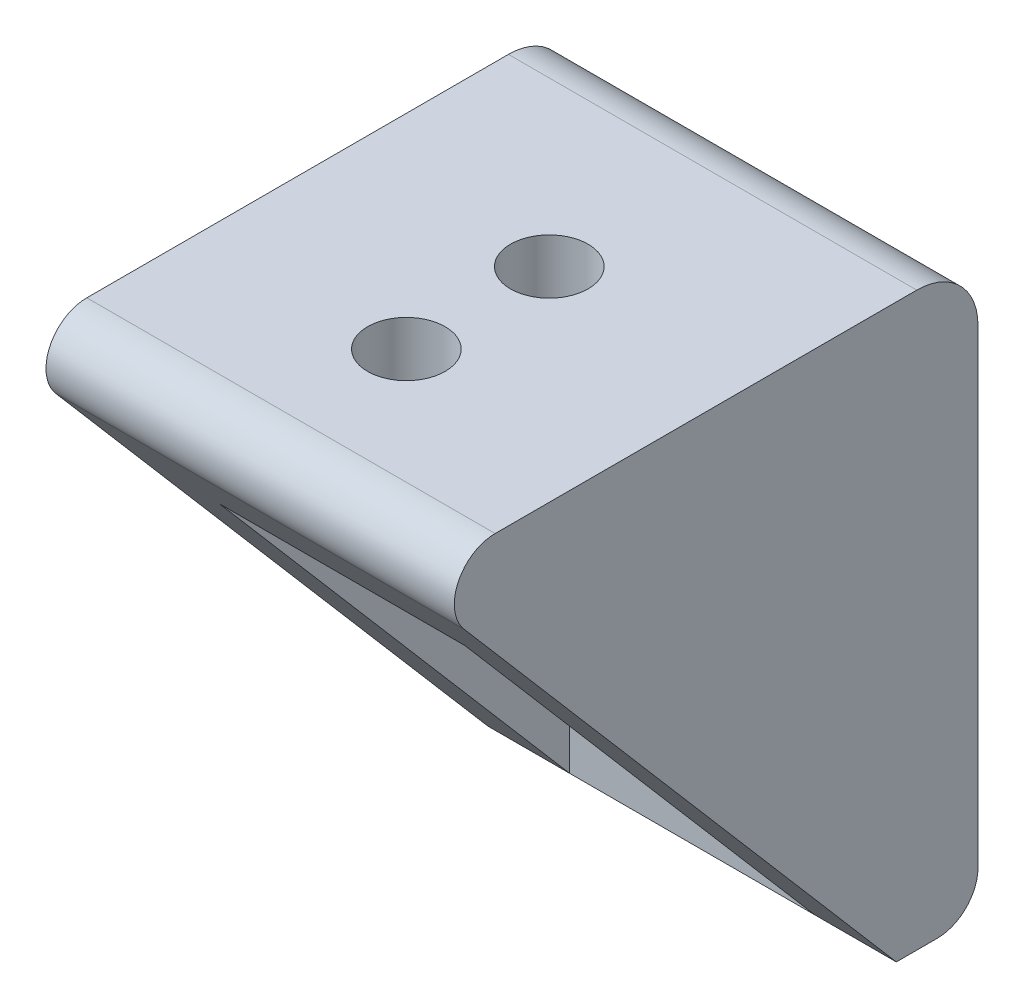
ISO-10303-21;
HEADER;
FILE_DESCRIPTION(('STEP AP214'),'2;1');
FILE_NAME('part.step','',(''),(''),'','','');
FILE_SCHEMA(('AUTOMOTIVE_DESIGN { 1 0 10303 214 1 1 1 1 }'));
ENDSEC;
DATA;
#1=APPLICATION_CONTEXT('core data for automotive mechanical design processes');
#2=APPLICATION_PROTOCOL_DEFINITION('international standard','automotive_design',2000,#1);
#3=PRODUCT_CONTEXT('',#1,'mechanical');
#4=PRODUCT('Part','Part','',(#3));
#5=PRODUCT_RELATED_PRODUCT_CATEGORY('part','',(#4));
#6=PRODUCT_DEFINITION_FORMATION('','',#4);
#7=PRODUCT_DEFINITION_CONTEXT('part definition',#1,'design');
#8=PRODUCT_DEFINITION('design','',#6,#7);
#9=PRODUCT_DEFINITION_SHAPE('','',#8);
#10=(LENGTH_UNIT() NAMED_UNIT(*) SI_UNIT(.MILLI.,.METRE.));
#11=(NAMED_UNIT(*) PLANE_ANGLE_UNIT() SI_UNIT($,.RADIAN.));
#12=(NAMED_UNIT(*) SI_UNIT($,.STERADIAN.) SOLID_ANGLE_UNIT());
#13=UNCERTAINTY_MEASURE_WITH_UNIT(LENGTH_MEASURE(1.E-05),#10,'distance_accuracy_value','');
#14=(GEOMETRIC_REPRESENTATION_CONTEXT(3) GLOBAL_UNCERTAINTY_ASSIGNED_CONTEXT((#13)) GLOBAL_UNIT_ASSIGNED_CONTEXT((#10,
#11,#12)) REPRESENTATION_CONTEXT('',''));
#15=CARTESIAN_POINT('',(0.,0.,0.));
#16=DIRECTION('',(0.,0.,1.));
#17=DIRECTION('',(1.,0.,0.));
#18=AXIS2_PLACEMENT_3D('',#15,#16,#17);
#19=CARTESIAN_POINT('',(-10.,-14.,28.));
#20=DIRECTION('',(0.,1.,0.));
#21=DIRECTION('',(0.,0.,1.));
#22=AXIS2_PLACEMENT_3D('',#19,#20,#21);
#23=PLANE('',#22);
#24=DIRECTION('',(0.,0.,-1.));
#25=VECTOR('',#24,1.);
#26=CARTESIAN_POINT('',(-10.,-14.,28.));
#27=LINE('',#26,#25);
#28=CARTESIAN_POINT('',(-10.,-14.,4.));
#29=VERTEX_POINT('',#28);
#30=CARTESIAN_POINT('',(-10.,-14.,2.));
#31=VERTEX_POINT('',#30);
#32=EDGE_CURVE('E126',#29,#31,#27,.T.);
#33=ORIENTED_EDGE('',*,*,#32,.T.);
#34=DIRECTION('',(1.,0.,0.));
#35=VECTOR('',#34,1.);
#36=CARTESIAN_POINT('',(10.,-14.,2.));
#37=LINE('',#36,#35);
#38=CARTESIAN_POINT('',(10.,-14.,2.));
#39=VERTEX_POINT('',#38);
#40=EDGE_CURVE('E157',#31,#39,#37,.T.);
#41=ORIENTED_EDGE('',*,*,#40,.T.);
#42=DIRECTION('',(0.,0.,-1.));
#43=VECTOR('',#42,1.);
#44=CARTESIAN_POINT('',(10.,-14.,28.));
#45=LINE('',#44,#43);
#46=CARTESIAN_POINT('',(10.,-14.,4.));
#47=VERTEX_POINT('',#46);
#48=EDGE_CURVE('E137',#47,#39,#45,.T.);
#49=ORIENTED_EDGE('',*,*,#48,.F.);
#50=DIRECTION('',(-1.,0.,0.));
#51=VECTOR('',#50,1.);
#52=CARTESIAN_POINT('',(46.8781778291715,-14.,4.));
#53=LINE('',#52,#51);
#54=CARTESIAN_POINT('',(6.,-14.,4.));
#55=VERTEX_POINT('',#54);
#56=EDGE_CURVE('E131',#47,#55,#53,.T.);
#57=ORIENTED_EDGE('',*,*,#56,.T.);
#58=DIRECTION('',(-1.,0.,0.));
#59=VECTOR('',#58,1.);
#60=CARTESIAN_POINT('',(41.2409987036266,-14.,4.));
#61=LINE('',#60,#59);
#62=CARTESIAN_POINT('',(-6.00000000000001,-14.,4.));
#63=VERTEX_POINT('',#62);
#64=EDGE_CURVE('E130',#55,#63,#61,.T.);
#65=ORIENTED_EDGE('',*,*,#64,.T.);
#66=EDGE_CURVE('E115',#63,#29,#53,.T.);
#67=ORIENTED_EDGE('',*,*,#66,.T.);
#68=EDGE_LOOP('',(#33,#41,#49,#57,#65,#67));
#69=FACE_BOUND('',#68,.T.);
#70=ADVANCED_FACE('F35',(#69),#23,.F.);
#71=CARTESIAN_POINT('',(10.,-14.,28.));
#72=DIRECTION('',(-1.,0.,0.));
#73=DIRECTION('',(0.,0.,1.));
#74=AXIS2_PLACEMENT_3D('',#71,#72,#73);
#75=PLANE('',#74);
#76=DIRECTION('',(0.,1.,0.));
#77=VECTOR('',#76,1.);
#78=CARTESIAN_POINT('',(10.,-14.,0.));
#79=LINE('',#78,#77);
#80=CARTESIAN_POINT('',(10.,-12.,0.));
#81=VERTEX_POINT('',#80);
#82=CARTESIAN_POINT('',(10.,11.,0.));
#83=VERTEX_POINT('',#82);
#84=EDGE_CURVE('E188',#81,#83,#79,.T.);
#85=ORIENTED_EDGE('',*,*,#84,.T.);
#86=CARTESIAN_POINT('',(10.,11.,3.));
#87=DIRECTION('',(-1.,0.,0.));
#88=DIRECTION('',(0.,0.,1.));
#89=AXIS2_PLACEMENT_3D('',#86,#87,#88);
#90=CIRCLE('',#89,3.);
#91=CARTESIAN_POINT('',(10.,14.,3.));
#92=VERTEX_POINT('',#91);
#93=EDGE_CURVE('E12',#83,#92,#90,.F.);
#94=ORIENTED_EDGE('',*,*,#93,.T.);
#95=DIRECTION('',(0.,0.,-1.));
#96=VECTOR('',#95,1.);
#97=CARTESIAN_POINT('',(10.,14.,28.));
#98=LINE('',#97,#96);
#99=CARTESIAN_POINT('',(10.,14.,23.6515587264877));
#100=VERTEX_POINT('',#99);
#101=EDGE_CURVE('E139',#100,#92,#98,.T.);
#102=ORIENTED_EDGE('',*,*,#101,.F.);
#103=CARTESIAN_POINT('',(10.,12.,23.6515587264877));
#104=DIRECTION('',(-1.,0.,0.));
#105=DIRECTION('',(0.,0.,1.));
#106=AXIS2_PLACEMENT_3D('',#103,#104,#105);
#107=CIRCLE('',#106,2.);
#108=CARTESIAN_POINT('',(10.,10.6984172530881,25.1700719312183));
#109=VERTEX_POINT('',#108);
#110=EDGE_CURVE('E155',#100,#109,#107,.F.);
#111=ORIENTED_EDGE('',*,*,#110,.T.);
#112=DIRECTION('',(0.,0.759256602365297,0.650791373455968));
#113=VECTOR('',#112,1.);
#114=CARTESIAN_POINT('',(10.,14.,28.));
#115=LINE('',#114,#113);
#116=EDGE_CURVE('E275',#47,#109,#115,.T.);
#117=ORIENTED_EDGE('',*,*,#116,.F.);
#118=ORIENTED_EDGE('',*,*,#48,.T.);
#119=CARTESIAN_POINT('',(10.,-12.,2.));
#120=DIRECTION('',(-1.,0.,0.));
#121=DIRECTION('',(0.,0.,1.));
#122=AXIS2_PLACEMENT_3D('',#119,#120,#121);
#123=CIRCLE('',#122,2.);
#124=EDGE_CURVE('E165',#39,#81,#123,.F.);
#125=ORIENTED_EDGE('',*,*,#124,.T.);
#126=EDGE_LOOP('',(#85,#94,#102,#111,#117,#118,#125));
#127=FACE_BOUND('',#126,.T.);
#128=ADVANCED_FACE('F186',(#127),#75,.F.);
#129=CARTESIAN_POINT('',(-10.,14.,28.));
#130=DIRECTION('',(0.,-1.,0.));
#131=DIRECTION('',(0.,0.,-1.));
#132=AXIS2_PLACEMENT_3D('',#129,#130,#131);
#133=PLANE('',#132);
#134=CARTESIAN_POINT('',(0.,14.,11.));
#135=DIRECTION('',(0.,1.,0.));
#136=DIRECTION('',(0.,0.,1.));
#137=AXIS2_PLACEMENT_3D('',#134,#135,#136);
#138=CIRCLE('',#137,1.9);
#139=CARTESIAN_POINT('',(0.,14.,12.9));
#140=VERTEX_POINT('',#139);
#141=EDGE_CURVE('E161',#140,#140,#138,.T.);
#142=ORIENTED_EDGE('',*,*,#141,.F.);
#143=EDGE_LOOP('',(#142));
#144=FACE_BOUND('',#143,.T.);
#145=CARTESIAN_POINT('',(0.,14.,18.));
#146=DIRECTION('',(0.,1.,0.));
#147=DIRECTION('',(0.,0.,1.));
#148=AXIS2_PLACEMENT_3D('',#145,#146,#147);
#149=CIRCLE('',#148,1.9);
#150=CARTESIAN_POINT('',(0.,14.,19.9));
#151=VERTEX_POINT('',#150);
#152=EDGE_CURVE('E283',#151,#151,#149,.T.);
#153=ORIENTED_EDGE('',*,*,#152,.F.);
#154=EDGE_LOOP('',(#153));
#155=FACE_BOUND('',#154,.T.);
#156=ORIENTED_EDGE('',*,*,#101,.T.);
#157=DIRECTION('',(-1.,0.,0.));
#158=VECTOR('',#157,1.);
#159=CARTESIAN_POINT('',(-10.,14.,3.));
#160=LINE('',#159,#158);
#161=CARTESIAN_POINT('',(-10.,14.,3.));
#162=VERTEX_POINT('',#161);
#163=EDGE_CURVE('E171',#92,#162,#160,.T.);
#164=ORIENTED_EDGE('',*,*,#163,.T.);
#165=DIRECTION('',(0.,0.,-1.));
#166=VECTOR('',#165,1.);
#167=CARTESIAN_POINT('',(-10.,14.,28.));
#168=LINE('',#167,#166);
#169=CARTESIAN_POINT('',(-10.,14.,23.6515587264877));
#170=VERTEX_POINT('',#169);
#171=EDGE_CURVE('E136',#170,#162,#168,.T.);
#172=ORIENTED_EDGE('',*,*,#171,.F.);
#173=DIRECTION('',(-1.,0.,0.));
#174=VECTOR('',#173,1.);
#175=CARTESIAN_POINT('',(-10.,14.,23.6515587264877));
#176=LINE('',#175,#174);
#177=EDGE_CURVE('E153',#170,#100,#176,.F.);
#178=ORIENTED_EDGE('',*,*,#177,.T.);
#179=EDGE_LOOP('',(#156,#164,#172,#178));
#180=FACE_BOUND('',#179,.T.);
#181=ADVANCED_FACE('F177',(#144,#155,#180),#133,.F.);
#182=CARTESIAN_POINT('',(-10.,-14.,28.));
#183=DIRECTION('',(1.,0.,0.));
#184=DIRECTION('',(0.,0.,-1.));
#185=AXIS2_PLACEMENT_3D('',#182,#183,#184);
#186=PLANE('',#185);
#187=ORIENTED_EDGE('',*,*,#171,.T.);
#188=CARTESIAN_POINT('',(-10.,11.,3.));
#189=DIRECTION('',(1.,0.,0.));
#190=DIRECTION('',(0.,0.,-1.));
#191=AXIS2_PLACEMENT_3D('',#188,#189,#190);
#192=CIRCLE('',#191,3.);
#193=CARTESIAN_POINT('',(-10.,11.,0.));
#194=VERTEX_POINT('',#193);
#195=EDGE_CURVE('E57',#162,#194,#192,.F.);
#196=ORIENTED_EDGE('',*,*,#195,.T.);
#197=DIRECTION('',(0.,-1.,0.));
#198=VECTOR('',#197,1.);
#199=CARTESIAN_POINT('',(-10.,-14.,0.));
#200=LINE('',#199,#198);
#201=CARTESIAN_POINT('',(-10.,-12.,0.));
#202=VERTEX_POINT('',#201);
#203=EDGE_CURVE('E142',#194,#202,#200,.T.);
#204=ORIENTED_EDGE('',*,*,#203,.T.);
#205=CARTESIAN_POINT('',(-10.,-12.,2.));
#206=DIRECTION('',(1.,0.,0.));
#207=DIRECTION('',(0.,0.,-1.));
#208=AXIS2_PLACEMENT_3D('',#205,#206,#207);
#209=CIRCLE('',#208,2.);
#210=EDGE_CURVE('E135',#202,#31,#209,.F.);
#211=ORIENTED_EDGE('',*,*,#210,.T.);
#212=ORIENTED_EDGE('',*,*,#32,.F.);
#213=DIRECTION('',(0.,-0.759256602365297,-0.650791373455968));
#214=VECTOR('',#213,1.);
#215=CARTESIAN_POINT('',(-10.,14.,28.));
#216=LINE('',#215,#214);
#217=CARTESIAN_POINT('',(-10.,10.6984172530881,25.1700719312183));
#218=VERTEX_POINT('',#217);
#219=EDGE_CURVE('E111',#218,#29,#216,.T.);
#220=ORIENTED_EDGE('',*,*,#219,.F.);
#221=CARTESIAN_POINT('',(-10.,12.,23.6515587264877));
#222=DIRECTION('',(1.,0.,0.));
#223=DIRECTION('',(0.,0.,-1.));
#224=AXIS2_PLACEMENT_3D('',#221,#222,#223);
#225=CIRCLE('',#224,2.);
#226=EDGE_CURVE('E151',#218,#170,#225,.F.);
#227=ORIENTED_EDGE('',*,*,#226,.T.);
#228=EDGE_LOOP('',(#187,#196,#204,#211,#212,#220,#227));
#229=FACE_BOUND('',#228,.T.);
#230=ADVANCED_FACE('F133',(#229),#186,.F.);
#231=CARTESIAN_POINT('',(0.,0.,0.));
#232=DIRECTION('',(0.,0.,-1.));
#233=DIRECTION('',(-1.,0.,0.));
#234=AXIS2_PLACEMENT_3D('',#231,#232,#233);
#235=PLANE('',#234);
#236=CARTESIAN_POINT('',(0.,-2.,0.));
#237=DIRECTION('',(0.,0.,1.));
#238=DIRECTION('',(1.,0.,0.));
#239=AXIS2_PLACEMENT_3D('',#236,#237,#238);
#240=CIRCLE('',#239,1.9);
#241=CARTESIAN_POINT('',(1.9,-2.,0.));
#242=VERTEX_POINT('',#241);
#243=EDGE_CURVE('E286',#242,#242,#240,.T.);
#244=ORIENTED_EDGE('',*,*,#243,.T.);
#245=EDGE_LOOP('',(#244));
#246=FACE_BOUND('',#245,.T.);
#247=CARTESIAN_POINT('',(0.,-10.,0.));
#248=DIRECTION('',(0.,0.,1.));
#249=DIRECTION('',(1.,0.,0.));
#250=AXIS2_PLACEMENT_3D('',#247,#248,#249);
#251=CIRCLE('',#250,1.9);
#252=CARTESIAN_POINT('',(1.9,-10.,0.));
#253=VERTEX_POINT('',#252);
#254=EDGE_CURVE('E290',#253,#253,#251,.T.);
#255=ORIENTED_EDGE('',*,*,#254,.T.);
#256=EDGE_LOOP('',(#255));
#257=FACE_BOUND('',#256,.T.);
#258=ORIENTED_EDGE('',*,*,#203,.F.);
#259=DIRECTION('',(-1.,0.,0.));
#260=VECTOR('',#259,1.);
#261=CARTESIAN_POINT('',(10.,11.,0.));
#262=LINE('',#261,#260);
#263=EDGE_CURVE('E43',#194,#83,#262,.F.);
#264=ORIENTED_EDGE('',*,*,#263,.T.);
#265=ORIENTED_EDGE('',*,*,#84,.F.);
#266=DIRECTION('',(1.,0.,0.));
#267=VECTOR('',#266,1.);
#268=CARTESIAN_POINT('',(-10.,-12.,0.));
#269=LINE('',#268,#267);
#270=EDGE_CURVE('E167',#81,#202,#269,.F.);
#271=ORIENTED_EDGE('',*,*,#270,.T.);
#272=EDGE_LOOP('',(#258,#264,#265,#271));
#273=FACE_BOUND('',#272,.T.);
#274=ADVANCED_FACE('F204',(#246,#257,#273),#235,.T.);
#275=CARTESIAN_POINT('',(41.2409987036266,6.,4.));
#276=DIRECTION('',(0.,0.,-1.));
#277=DIRECTION('',(0.,1.,0.));
#278=AXIS2_PLACEMENT_3D('',#275,#276,#277);
#279=PLANE('',#278);
#280=CARTESIAN_POINT('',(0.,-2.,4.));
#281=DIRECTION('',(0.,0.,1.));
#282=DIRECTION('',(1.,0.,0.));
#283=AXIS2_PLACEMENT_3D('',#280,#281,#282);
#284=CIRCLE('',#283,1.9);
#285=CARTESIAN_POINT('',(1.9,-2.,4.));
#286=VERTEX_POINT('',#285);
#287=EDGE_CURVE('E246',#286,#286,#284,.T.);
#288=ORIENTED_EDGE('',*,*,#287,.F.);
#289=EDGE_LOOP('',(#288));
#290=FACE_BOUND('',#289,.T.);
#291=CARTESIAN_POINT('',(0.,-10.,4.));
#292=DIRECTION('',(0.,0.,1.));
#293=DIRECTION('',(1.,0.,0.));
#294=AXIS2_PLACEMENT_3D('',#291,#292,#293);
#295=CIRCLE('',#294,1.9);
#296=CARTESIAN_POINT('',(1.9,-10.,4.));
#297=VERTEX_POINT('',#296);
#298=EDGE_CURVE('E250',#297,#297,#295,.T.);
#299=ORIENTED_EDGE('',*,*,#298,.F.);
#300=EDGE_LOOP('',(#299));
#301=FACE_BOUND('',#300,.T.);
#302=DIRECTION('',(0.,1.,0.));
#303=VECTOR('',#302,1.);
#304=CARTESIAN_POINT('',(6.,6.,4.));
#305=LINE('',#304,#303);
#306=CARTESIAN_POINT('',(6.,6.,4.));
#307=VERTEX_POINT('',#306);
#308=EDGE_CURVE('E252',#55,#307,#305,.T.);
#309=ORIENTED_EDGE('',*,*,#308,.T.);
#310=DIRECTION('',(-1.,0.,0.));
#311=VECTOR('',#310,1.);
#312=CARTESIAN_POINT('',(41.2409987036266,6.,4.));
#313=LINE('',#312,#311);
#314=CARTESIAN_POINT('',(-6.00000000000001,6.,4.));
#315=VERTEX_POINT('',#314);
#316=EDGE_CURVE('E256',#307,#315,#313,.T.);
#317=ORIENTED_EDGE('',*,*,#316,.T.);
#318=DIRECTION('',(0.,1.,0.));
#319=VECTOR('',#318,1.);
#320=CARTESIAN_POINT('',(-6.00000000000001,6.,4.));
#321=LINE('',#320,#319);
#322=EDGE_CURVE('E270',#63,#315,#321,.T.);
#323=ORIENTED_EDGE('',*,*,#322,.F.);
#324=ORIENTED_EDGE('',*,*,#64,.F.);
#325=EDGE_LOOP('',(#309,#317,#323,#324));
#326=FACE_BOUND('',#325,.T.);
#327=ADVANCED_FACE('F235',(#290,#301,#326),#279,.F.);
#328=CARTESIAN_POINT('',(41.2409987036266,6.,4.));
#329=DIRECTION('',(0.,1.,0.));
#330=DIRECTION('',(0.,0.,1.));
#331=AXIS2_PLACEMENT_3D('',#328,#329,#330);
#332=PLANE('',#331);
#333=CARTESIAN_POINT('',(0.,6.,11.));
#334=DIRECTION('',(0.,1.,0.));
#335=DIRECTION('',(0.,0.,1.));
#336=AXIS2_PLACEMENT_3D('',#333,#334,#335);
#337=CIRCLE('',#336,1.9);
#338=CARTESIAN_POINT('',(0.,6.,12.9));
#339=VERTEX_POINT('',#338);
#340=EDGE_CURVE('E120',#339,#339,#337,.T.);
#341=ORIENTED_EDGE('',*,*,#340,.T.);
#342=EDGE_LOOP('',(#341));
#343=FACE_BOUND('',#342,.T.);
#344=CARTESIAN_POINT('',(0.,6.,18.));
#345=DIRECTION('',(0.,1.,0.));
#346=DIRECTION('',(0.,0.,1.));
#347=AXIS2_PLACEMENT_3D('',#344,#345,#346);
#348=CIRCLE('',#347,1.9);
#349=CARTESIAN_POINT('',(0.,6.,19.9));
#350=VERTEX_POINT('',#349);
#351=EDGE_CURVE('E158',#350,#350,#348,.T.);
#352=ORIENTED_EDGE('',*,*,#351,.T.);
#353=EDGE_LOOP('',(#352));
#354=FACE_BOUND('',#353,.T.);
#355=DIRECTION('',(0.,0.,1.));
#356=VECTOR('',#355,1.);
#357=CARTESIAN_POINT('',(6.,6.,4.));
#358=LINE('',#357,#356);
#359=CARTESIAN_POINT('',(6.,6.,21.1428571428571));
#360=VERTEX_POINT('',#359);
#361=EDGE_CURVE('E259',#307,#360,#358,.T.);
#362=ORIENTED_EDGE('',*,*,#361,.T.);
#363=DIRECTION('',(-1.,0.,0.));
#364=VECTOR('',#363,1.);
#365=CARTESIAN_POINT('',(41.2409987036266,6.,21.1428571428571));
#366=LINE('',#365,#364);
#367=CARTESIAN_POINT('',(-6.,6.,21.1428571428571));
#368=VERTEX_POINT('',#367);
#369=EDGE_CURVE('E276',#360,#368,#366,.T.);
#370=ORIENTED_EDGE('',*,*,#369,.T.);
#371=DIRECTION('',(0.,0.,1.));
#372=VECTOR('',#371,1.);
#373=CARTESIAN_POINT('',(-6.00000000000001,6.,4.));
#374=LINE('',#373,#372);
#375=EDGE_CURVE('E267',#315,#368,#374,.T.);
#376=ORIENTED_EDGE('',*,*,#375,.F.);
#377=ORIENTED_EDGE('',*,*,#316,.F.);
#378=EDGE_LOOP('',(#362,#370,#376,#377));
#379=FACE_BOUND('',#378,.T.);
#380=ADVANCED_FACE('F232',(#343,#354,#379),#332,.F.);
#381=CARTESIAN_POINT('',(6.,-14.,28.));
#382=DIRECTION('',(-1.,0.,0.));
#383=DIRECTION('',(0.,0.,1.));
#384=AXIS2_PLACEMENT_3D('',#381,#382,#383);
#385=PLANE('',#384);
#386=DIRECTION('',(0.,-0.759256602365297,-0.650791373455968));
#387=VECTOR('',#386,1.);
#388=CARTESIAN_POINT('',(6.,-2.14117647058824,14.1647058823529));
#389=LINE('',#388,#387);
#390=EDGE_CURVE('E262',#360,#55,#389,.T.);
#391=ORIENTED_EDGE('',*,*,#390,.F.);
#392=ORIENTED_EDGE('',*,*,#361,.F.);
#393=ORIENTED_EDGE('',*,*,#308,.F.);
#394=EDGE_LOOP('',(#391,#392,#393));
#395=FACE_BOUND('',#394,.T.);
#396=ADVANCED_FACE('F225',(#395),#385,.T.);
#397=CARTESIAN_POINT('',(-6.,-14.,28.));
#398=DIRECTION('',(1.,0.,0.));
#399=DIRECTION('',(0.,0.,-1.));
#400=AXIS2_PLACEMENT_3D('',#397,#398,#399);
#401=PLANE('',#400);
#402=DIRECTION('',(0.,0.759256602365297,0.650791373455968));
#403=VECTOR('',#402,1.);
#404=CARTESIAN_POINT('',(-6.,-2.14117647058824,14.1647058823529));
#405=LINE('',#404,#403);
#406=EDGE_CURVE('E148',#63,#368,#405,.T.);
#407=ORIENTED_EDGE('',*,*,#406,.F.);
#408=ORIENTED_EDGE('',*,*,#322,.T.);
#409=ORIENTED_EDGE('',*,*,#375,.T.);
#410=EDGE_LOOP('',(#407,#408,#409));
#411=FACE_BOUND('',#410,.T.);
#412=ADVANCED_FACE('F220',(#411),#401,.T.);
#413=CARTESIAN_POINT('',(46.8781778291715,14.,28.));
#414=DIRECTION('',(0.,0.650791373455968,-0.759256602365297));
#415=DIRECTION('',(0.,0.759256602365297,0.650791373455968));
#416=AXIS2_PLACEMENT_3D('',#413,#414,#415);
#417=PLANE('',#416);
#418=ORIENTED_EDGE('',*,*,#116,.T.);
#419=DIRECTION('',(-1.,0.,0.));
#420=VECTOR('',#419,1.);
#421=CARTESIAN_POINT('',(46.8781778291715,10.6984172530881,25.1700719312183));
#422=LINE('',#421,#420);
#423=EDGE_CURVE('E118',#109,#218,#422,.T.);
#424=ORIENTED_EDGE('',*,*,#423,.T.);
#425=ORIENTED_EDGE('',*,*,#219,.T.);
#426=ORIENTED_EDGE('',*,*,#66,.F.);
#427=ORIENTED_EDGE('',*,*,#406,.T.);
#428=ORIENTED_EDGE('',*,*,#369,.F.);
#429=ORIENTED_EDGE('',*,*,#390,.T.);
#430=ORIENTED_EDGE('',*,*,#56,.F.);
#431=EDGE_LOOP('',(#418,#424,#425,#426,#427,#428,#429,#430));
#432=FACE_BOUND('',#431,.T.);
#433=ADVANCED_FACE('F114',(#432),#417,.F.);
#434=CARTESIAN_POINT('',(46.8781778291715,12.,23.6515587264877));
#435=DIRECTION('',(-1.,0.,0.));
#436=DIRECTION('',(0.,0.,1.));
#437=AXIS2_PLACEMENT_3D('',#434,#435,#436);
#438=CYLINDRICAL_SURFACE('',#437,2.);
#439=ORIENTED_EDGE('',*,*,#110,.F.);
#440=ORIENTED_EDGE('',*,*,#177,.F.);
#441=ORIENTED_EDGE('',*,*,#226,.F.);
#442=ORIENTED_EDGE('',*,*,#423,.F.);
#443=EDGE_LOOP('',(#439,#440,#441,#442));
#444=FACE_BOUND('',#443,.T.);
#445=ADVANCED_FACE('F184',(#444),#438,.T.);
#446=CARTESIAN_POINT('',(0.,4.,18.));
#447=DIRECTION('',(0.,1.,0.));
#448=DIRECTION('',(0.,0.,1.));
#449=AXIS2_PLACEMENT_3D('',#446,#447,#448);
#450=CYLINDRICAL_SURFACE('',#449,1.9);
#451=ORIENTED_EDGE('',*,*,#152,.T.);
#452=EDGE_LOOP('',(#451));
#453=FACE_BOUND('',#452,.T.);
#454=ORIENTED_EDGE('',*,*,#351,.F.);
#455=EDGE_LOOP('',(#454));
#456=FACE_BOUND('',#455,.T.);
#457=ADVANCED_FACE('F212',(#453,#456),#450,.F.);
#458=CARTESIAN_POINT('',(0.,4.,11.));
#459=DIRECTION('',(0.,1.,0.));
#460=DIRECTION('',(0.,0.,1.));
#461=AXIS2_PLACEMENT_3D('',#458,#459,#460);
#462=CYLINDRICAL_SURFACE('',#461,1.9);
#463=ORIENTED_EDGE('',*,*,#141,.T.);
#464=EDGE_LOOP('',(#463));
#465=FACE_BOUND('',#464,.T.);
#466=ORIENTED_EDGE('',*,*,#340,.F.);
#467=EDGE_LOOP('',(#466));
#468=FACE_BOUND('',#467,.T.);
#469=ADVANCED_FACE('F217',(#465,#468),#462,.F.);
#470=CARTESIAN_POINT('',(0.,-10.,0.));
#471=DIRECTION('',(0.,0.,1.));
#472=DIRECTION('',(1.,0.,0.));
#473=AXIS2_PLACEMENT_3D('',#470,#471,#472);
#474=CYLINDRICAL_SURFACE('',#473,1.9);
#475=ORIENTED_EDGE('',*,*,#254,.F.);
#476=EDGE_LOOP('',(#475));
#477=FACE_BOUND('',#476,.T.);
#478=ORIENTED_EDGE('',*,*,#298,.T.);
#479=EDGE_LOOP('',(#478));
#480=FACE_BOUND('',#479,.T.);
#481=ADVANCED_FACE('F300',(#477,#480),#474,.F.);
#482=CARTESIAN_POINT('',(0.,-2.,0.));
#483=DIRECTION('',(0.,0.,1.));
#484=DIRECTION('',(1.,0.,0.));
#485=AXIS2_PLACEMENT_3D('',#482,#483,#484);
#486=CYLINDRICAL_SURFACE('',#485,1.9);
#487=ORIENTED_EDGE('',*,*,#243,.F.);
#488=EDGE_LOOP('',(#487));
#489=FACE_BOUND('',#488,.T.);
#490=ORIENTED_EDGE('',*,*,#287,.T.);
#491=EDGE_LOOP('',(#490));
#492=FACE_BOUND('',#491,.T.);
#493=ADVANCED_FACE('F194',(#489,#492),#486,.F.);
#494=CARTESIAN_POINT('',(-10.,-12.,2.));
#495=DIRECTION('',(-1.,0.,0.));
#496=DIRECTION('',(0.,0.,1.));
#497=AXIS2_PLACEMENT_3D('',#494,#495,#496);
#498=CYLINDRICAL_SURFACE('',#497,2.);
#499=ORIENTED_EDGE('',*,*,#210,.F.);
#500=ORIENTED_EDGE('',*,*,#270,.F.);
#501=ORIENTED_EDGE('',*,*,#124,.F.);
#502=ORIENTED_EDGE('',*,*,#40,.F.);
#503=EDGE_LOOP('',(#499,#500,#501,#502));
#504=FACE_BOUND('',#503,.T.);
#505=ADVANCED_FACE('F190',(#504),#498,.T.);
#506=CARTESIAN_POINT('',(-10.,11.,3.));
#507=DIRECTION('',(1.,0.,0.));
#508=DIRECTION('',(0.,0.,-1.));
#509=AXIS2_PLACEMENT_3D('',#506,#507,#508);
#510=CYLINDRICAL_SURFACE('',#509,3.);
#511=ORIENTED_EDGE('',*,*,#93,.F.);
#512=ORIENTED_EDGE('',*,*,#263,.F.);
#513=ORIENTED_EDGE('',*,*,#195,.F.);
#514=ORIENTED_EDGE('',*,*,#163,.F.);
#515=EDGE_LOOP('',(#511,#512,#513,#514));
#516=FACE_BOUND('',#515,.T.);
#517=ADVANCED_FACE('F37',(#516),#510,.T.);
#518=CLOSED_SHELL('',(#70,#128,#181,#230,#274,#327,#380,#396,#412,#433,#445,#457,#469,#481,#493,
#505,#517));
#519=MANIFOLD_SOLID_BREP('B2',#518);
#520=ADVANCED_BREP_SHAPE_REPRESENTATION('',(#18,#519),#14);
#521=SHAPE_DEFINITION_REPRESENTATION(#9,#520);
ENDSEC;
END-ISO-10303-21;
